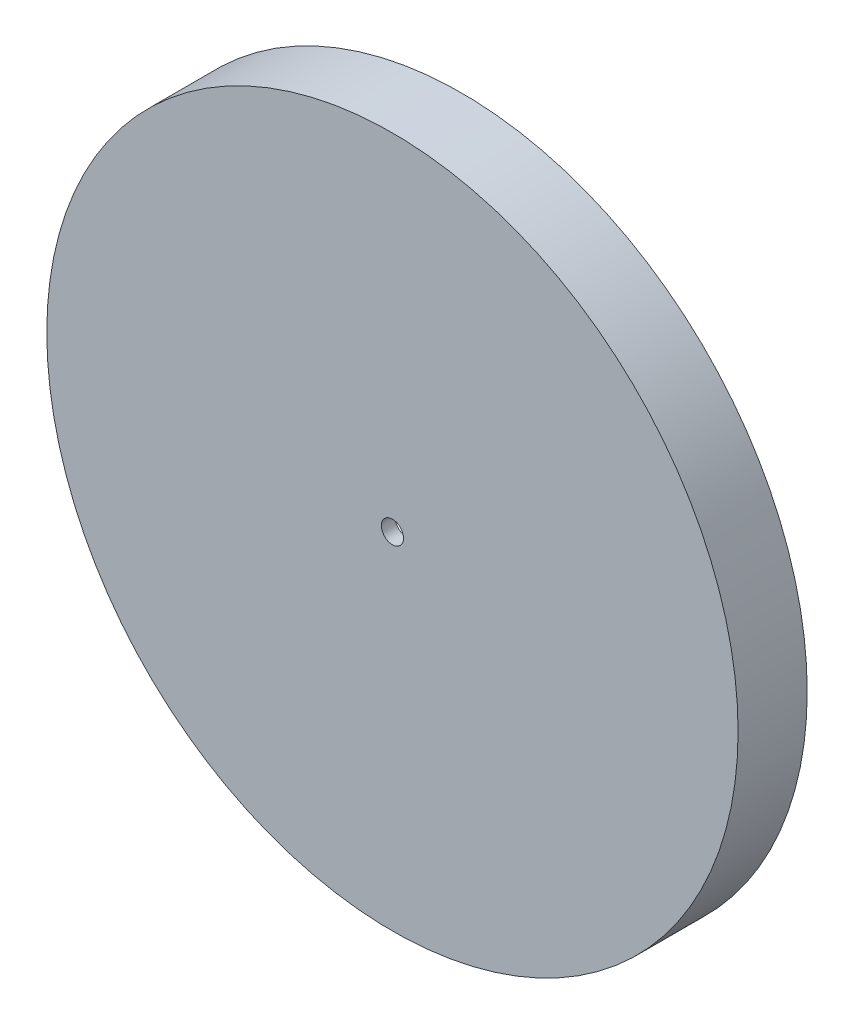
ISO-10303-21;
HEADER;
FILE_DESCRIPTION(('STEP AP214'),'2;1');
FILE_NAME('part.step','',(''),(''),'','','');
FILE_SCHEMA(('AUTOMOTIVE_DESIGN { 1 0 10303 214 1 1 1 1 }'));
ENDSEC;
DATA;
#1=APPLICATION_CONTEXT('core data for automotive mechanical design processes');
#2=APPLICATION_PROTOCOL_DEFINITION('international standard','automotive_design',2000,#1);
#3=PRODUCT_CONTEXT('',#1,'mechanical');
#4=PRODUCT('Part','Part','',(#3));
#5=PRODUCT_RELATED_PRODUCT_CATEGORY('part','',(#4));
#6=PRODUCT_DEFINITION_FORMATION('','',#4);
#7=PRODUCT_DEFINITION_CONTEXT('part definition',#1,'design');
#8=PRODUCT_DEFINITION('design','',#6,#7);
#9=PRODUCT_DEFINITION_SHAPE('','',#8);
#10=(LENGTH_UNIT() NAMED_UNIT(*) SI_UNIT(.MILLI.,.METRE.));
#11=(NAMED_UNIT(*) PLANE_ANGLE_UNIT() SI_UNIT($,.RADIAN.));
#12=(NAMED_UNIT(*) SI_UNIT($,.STERADIAN.) SOLID_ANGLE_UNIT());
#13=UNCERTAINTY_MEASURE_WITH_UNIT(LENGTH_MEASURE(1.E-05),#10,'distance_accuracy_value','');
#14=(GEOMETRIC_REPRESENTATION_CONTEXT(3) GLOBAL_UNCERTAINTY_ASSIGNED_CONTEXT((#13)) GLOBAL_UNIT_ASSIGNED_CONTEXT((#10,
#11,#12)) REPRESENTATION_CONTEXT('',''));
#15=CARTESIAN_POINT('',(0.,0.,0.));
#16=DIRECTION('',(0.,0.,1.));
#17=DIRECTION('',(1.,0.,0.));
#18=AXIS2_PLACEMENT_3D('',#15,#16,#17);
#19=CARTESIAN_POINT('',(0.,0.,0.));
#20=DIRECTION('',(0.,0.,1.));
#21=DIRECTION('',(1.,0.,0.));
#22=AXIS2_PLACEMENT_3D('',#19,#20,#21);
#23=PLANE('',#22);
#24=CARTESIAN_POINT('',(0.,0.,0.));
#25=DIRECTION('',(0.,0.,1.));
#26=DIRECTION('',(1.,0.,0.));
#27=AXIS2_PLACEMENT_3D('',#24,#25,#26);
#28=CIRCLE('',#27,2.);
#29=CARTESIAN_POINT('',(2.,0.,0.));
#30=VERTEX_POINT('',#29);
#31=EDGE_CURVE('E54',#30,#30,#28,.T.);
#32=ORIENTED_EDGE('',*,*,#31,.T.);
#33=EDGE_LOOP('',(#32));
#34=FACE_BOUND('',#33,.T.);
#35=CARTESIAN_POINT('',(0.,0.,0.));
#36=DIRECTION('',(0.,0.,1.));
#37=DIRECTION('',(1.,0.,0.));
#38=AXIS2_PLACEMENT_3D('',#35,#36,#37);
#39=CIRCLE('',#38,60.);
#40=CARTESIAN_POINT('',(60.,0.,0.));
#41=VERTEX_POINT('',#40);
#42=EDGE_CURVE('E11',#41,#41,#39,.T.);
#43=ORIENTED_EDGE('',*,*,#42,.F.);
#44=EDGE_LOOP('',(#43));
#45=FACE_BOUND('',#44,.T.);
#46=ADVANCED_FACE('F38',(#34,#45),#23,.F.);
#47=CARTESIAN_POINT('',(0.,0.,2.5));
#48=DIRECTION('',(0.,0.,-1.));
#49=DIRECTION('',(-1.,0.,0.));
#50=AXIS2_PLACEMENT_3D('',#47,#48,#49);
#51=CYLINDRICAL_SURFACE('',#50,2.);
#52=CARTESIAN_POINT('',(0.,0.,2.5));
#53=DIRECTION('',(0.,0.,1.));
#54=DIRECTION('',(1.,0.,0.));
#55=AXIS2_PLACEMENT_3D('',#52,#53,#54);
#56=CIRCLE('',#55,2.);
#57=CARTESIAN_POINT('',(2.,0.,2.5));
#58=VERTEX_POINT('',#57);
#59=EDGE_CURVE('E49',#58,#58,#56,.T.);
#60=ORIENTED_EDGE('',*,*,#59,.T.);
#61=EDGE_LOOP('',(#60));
#62=FACE_BOUND('',#61,.T.);
#63=ORIENTED_EDGE('',*,*,#31,.F.);
#64=EDGE_LOOP('',(#63));
#65=FACE_BOUND('',#64,.T.);
#66=ADVANCED_FACE('F40',(#62,#65),#51,.F.);
#67=CARTESIAN_POINT('',(0.,0.,2.5));
#68=DIRECTION('',(0.,0.,-1.));
#69=DIRECTION('',(-1.,0.,0.));
#70=AXIS2_PLACEMENT_3D('',#67,#68,#69);
#71=CYLINDRICAL_SURFACE('',#70,62.5);
#72=CARTESIAN_POINT('',(0.,0.,2.5));
#73=DIRECTION('',(0.,0.,1.));
#74=DIRECTION('',(1.,0.,0.));
#75=AXIS2_PLACEMENT_3D('',#72,#73,#74);
#76=CIRCLE('',#75,62.5);
#77=CARTESIAN_POINT('',(62.5,0.,2.5));
#78=VERTEX_POINT('',#77);
#79=EDGE_CURVE('E45',#78,#78,#76,.T.);
#80=ORIENTED_EDGE('',*,*,#79,.F.);
#81=EDGE_LOOP('',(#80));
#82=FACE_BOUND('',#81,.T.);
#83=CARTESIAN_POINT('',(0.,0.,-10.));
#84=DIRECTION('',(0.,0.,1.));
#85=DIRECTION('',(1.,0.,0.));
#86=AXIS2_PLACEMENT_3D('',#83,#84,#85);
#87=CIRCLE('',#86,62.5);
#88=CARTESIAN_POINT('',(62.5,0.,-10.));
#89=VERTEX_POINT('',#88);
#90=EDGE_CURVE('E58',#89,#89,#87,.T.);
#91=ORIENTED_EDGE('',*,*,#90,.T.);
#92=EDGE_LOOP('',(#91));
#93=FACE_BOUND('',#92,.T.);
#94=ADVANCED_FACE('F85',(#82,#93),#71,.T.);
#95=CARTESIAN_POINT('',(0.,0.,2.5));
#96=DIRECTION('',(0.,0.,1.));
#97=DIRECTION('',(1.,0.,0.));
#98=AXIS2_PLACEMENT_3D('',#95,#96,#97);
#99=PLANE('',#98);
#100=ORIENTED_EDGE('',*,*,#59,.F.);
#101=EDGE_LOOP('',(#100));
#102=FACE_BOUND('',#101,.T.);
#103=ORIENTED_EDGE('',*,*,#79,.T.);
#104=EDGE_LOOP('',(#103));
#105=FACE_BOUND('',#104,.T.);
#106=ADVANCED_FACE('F78',(#102,#105),#99,.T.);
#107=CARTESIAN_POINT('',(0.,0.,-10.));
#108=DIRECTION('',(0.,0.,1.));
#109=DIRECTION('',(1.,0.,0.));
#110=AXIS2_PLACEMENT_3D('',#107,#108,#109);
#111=PLANE('',#110);
#112=CARTESIAN_POINT('',(0.,0.,-10.));
#113=DIRECTION('',(0.,0.,1.));
#114=DIRECTION('',(1.,0.,0.));
#115=AXIS2_PLACEMENT_3D('',#112,#113,#114);
#116=CIRCLE('',#115,60.);
#117=CARTESIAN_POINT('',(60.,0.,-10.));
#118=VERTEX_POINT('',#117);
#119=EDGE_CURVE('E62',#118,#118,#116,.T.);
#120=ORIENTED_EDGE('',*,*,#119,.T.);
#121=EDGE_LOOP('',(#120));
#122=FACE_BOUND('',#121,.T.);
#123=ORIENTED_EDGE('',*,*,#90,.F.);
#124=EDGE_LOOP('',(#123));
#125=FACE_BOUND('',#124,.T.);
#126=ADVANCED_FACE('F69',(#122,#125),#111,.F.);
#127=CARTESIAN_POINT('',(0.,0.,-10.));
#128=DIRECTION('',(0.,0.,1.));
#129=DIRECTION('',(1.,0.,0.));
#130=AXIS2_PLACEMENT_3D('',#127,#128,#129);
#131=CYLINDRICAL_SURFACE('',#130,60.);
#132=ORIENTED_EDGE('',*,*,#119,.F.);
#133=EDGE_LOOP('',(#132));
#134=FACE_BOUND('',#133,.T.);
#135=ORIENTED_EDGE('',*,*,#42,.T.);
#136=EDGE_LOOP('',(#135));
#137=FACE_BOUND('',#136,.T.);
#138=ADVANCED_FACE('F72',(#134,#137),#131,.F.);
#139=CLOSED_SHELL('',(#46,#66,#94,#106,#126,#138));
#140=MANIFOLD_SOLID_BREP('B2',#139);
#141=ADVANCED_BREP_SHAPE_REPRESENTATION('',(#18,#140),#14);
#142=SHAPE_DEFINITION_REPRESENTATION(#9,#141);
ENDSEC;
END-ISO-10303-21;
